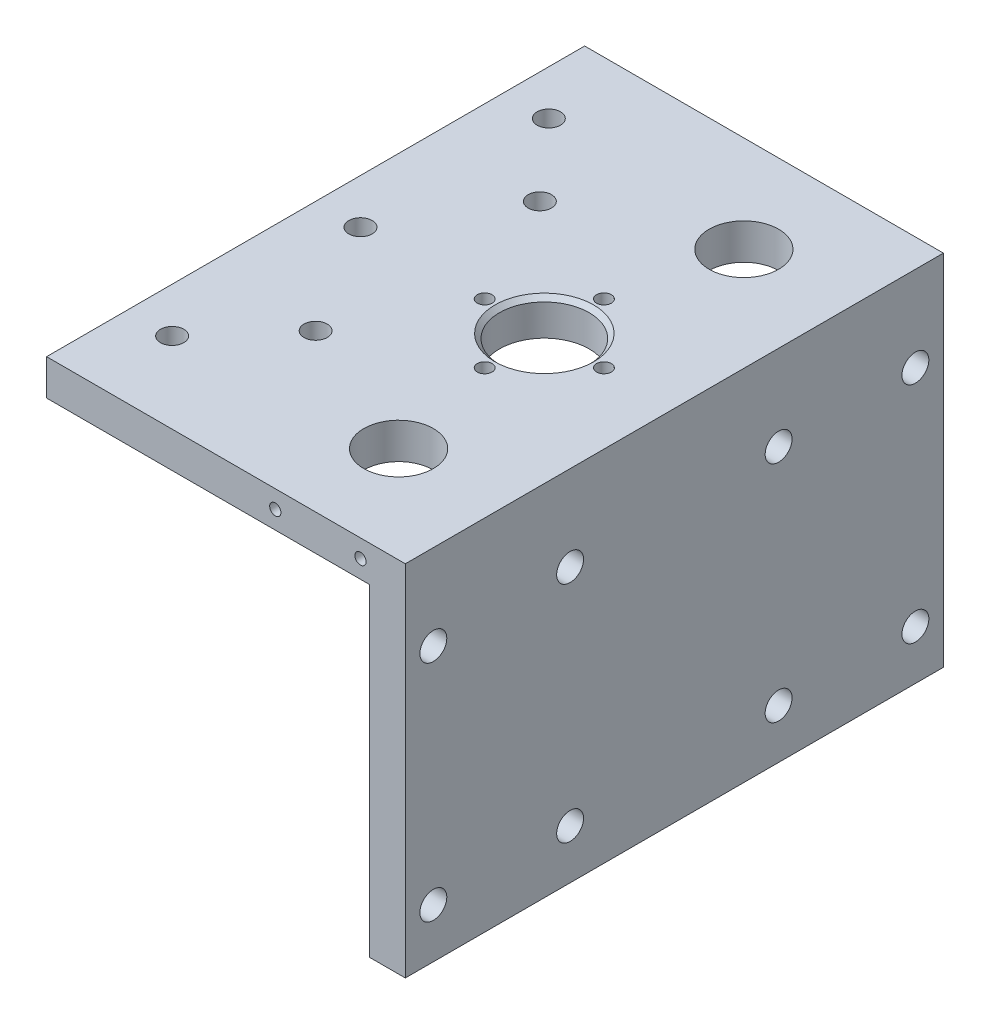
ISO-10303-21;
HEADER;
FILE_DESCRIPTION(('STEP AP214'),'2;1');
FILE_NAME('part.step','',(''),(''),'','','');
FILE_SCHEMA(('AUTOMOTIVE_DESIGN { 1 0 10303 214 1 1 1 1 }'));
ENDSEC;
DATA;
#1=APPLICATION_CONTEXT('core data for automotive mechanical design processes');
#2=APPLICATION_PROTOCOL_DEFINITION('international standard','automotive_design',2000,#1);
#3=PRODUCT_CONTEXT('',#1,'mechanical');
#4=PRODUCT('Part','Part','',(#3));
#5=PRODUCT_RELATED_PRODUCT_CATEGORY('part','',(#4));
#6=PRODUCT_DEFINITION_FORMATION('','',#4);
#7=PRODUCT_DEFINITION_CONTEXT('part definition',#1,'design');
#8=PRODUCT_DEFINITION('design','',#6,#7);
#9=PRODUCT_DEFINITION_SHAPE('','',#8);
#10=(LENGTH_UNIT() NAMED_UNIT(*) SI_UNIT(.MILLI.,.METRE.));
#11=(NAMED_UNIT(*) PLANE_ANGLE_UNIT() SI_UNIT($,.RADIAN.));
#12=(NAMED_UNIT(*) SI_UNIT($,.STERADIAN.) SOLID_ANGLE_UNIT());
#13=UNCERTAINTY_MEASURE_WITH_UNIT(LENGTH_MEASURE(1.E-05),#10,'distance_accuracy_value','');
#14=(GEOMETRIC_REPRESENTATION_CONTEXT(3) GLOBAL_UNCERTAINTY_ASSIGNED_CONTEXT((#13)) GLOBAL_UNIT_ASSIGNED_CONTEXT((#10,
#11,#12)) REPRESENTATION_CONTEXT('',''));
#15=CARTESIAN_POINT('',(0.,0.,0.));
#16=DIRECTION('',(0.,0.,1.));
#17=DIRECTION('',(1.,0.,0.));
#18=AXIS2_PLACEMENT_3D('',#15,#16,#17);
#19=CARTESIAN_POINT('',(0.,-80.,120.));
#20=DIRECTION('',(-1.,0.,0.));
#21=DIRECTION('',(0.,0.,1.));
#22=AXIS2_PLACEMENT_3D('',#19,#20,#21);
#23=PLANE('',#22);
#24=CARTESIAN_POINT('',(0.,-69.,36.75));
#25=DIRECTION('',(1.,0.,0.));
#26=DIRECTION('',(0.,0.,1.));
#27=AXIS2_PLACEMENT_3D('',#24,#25,#26);
#28=CIRCLE('',#27,3.);
#29=CARTESIAN_POINT('',(0.,-69.,39.75));
#30=VERTEX_POINT('',#29);
#31=EDGE_CURVE('E195',#30,#30,#28,.T.);
#32=ORIENTED_EDGE('',*,*,#31,.F.);
#33=EDGE_LOOP('',(#32));
#34=FACE_BOUND('',#33,.T.);
#35=CARTESIAN_POINT('',(0.,-69.,6.25));
#36=DIRECTION('',(1.,0.,0.));
#37=DIRECTION('',(0.,0.,-1.));
#38=AXIS2_PLACEMENT_3D('',#35,#36,#37);
#39=CIRCLE('',#38,3.);
#40=CARTESIAN_POINT('',(0.,-69.,3.25));
#41=VERTEX_POINT('',#40);
#42=EDGE_CURVE('E191',#41,#41,#39,.T.);
#43=ORIENTED_EDGE('',*,*,#42,.F.);
#44=EDGE_LOOP('',(#43));
#45=FACE_BOUND('',#44,.T.);
#46=CARTESIAN_POINT('',(0.,-69.,113.75));
#47=DIRECTION('',(1.,0.,0.));
#48=DIRECTION('',(0.,0.,1.));
#49=AXIS2_PLACEMENT_3D('',#46,#47,#48);
#50=CIRCLE('',#49,3.00000000000001);
#51=CARTESIAN_POINT('',(0.,-69.,116.75));
#52=VERTEX_POINT('',#51);
#53=EDGE_CURVE('E187',#52,#52,#50,.T.);
#54=ORIENTED_EDGE('',*,*,#53,.F.);
#55=EDGE_LOOP('',(#54));
#56=FACE_BOUND('',#55,.T.);
#57=CARTESIAN_POINT('',(0.,-69.,83.25));
#58=DIRECTION('',(1.,0.,0.));
#59=DIRECTION('',(0.,0.,-1.));
#60=AXIS2_PLACEMENT_3D('',#57,#58,#59);
#61=CIRCLE('',#60,3.00000000000001);
#62=CARTESIAN_POINT('',(0.,-69.,80.25));
#63=VERTEX_POINT('',#62);
#64=EDGE_CURVE('E183',#63,#63,#61,.T.);
#65=ORIENTED_EDGE('',*,*,#64,.F.);
#66=EDGE_LOOP('',(#65));
#67=FACE_BOUND('',#66,.T.);
#68=CARTESIAN_POINT('',(0.,-19.,6.25));
#69=DIRECTION('',(1.,0.,0.));
#70=DIRECTION('',(0.,0.,1.));
#71=AXIS2_PLACEMENT_3D('',#68,#69,#70);
#72=CIRCLE('',#71,3.);
#73=CARTESIAN_POINT('',(0.,-19.,9.25));
#74=VERTEX_POINT('',#73);
#75=EDGE_CURVE('E179',#74,#74,#72,.T.);
#76=ORIENTED_EDGE('',*,*,#75,.F.);
#77=EDGE_LOOP('',(#76));
#78=FACE_BOUND('',#77,.T.);
#79=CARTESIAN_POINT('',(0.,-19.,36.75));
#80=DIRECTION('',(1.,0.,0.));
#81=DIRECTION('',(0.,0.,-1.));
#82=AXIS2_PLACEMENT_3D('',#79,#80,#81);
#83=CIRCLE('',#82,3.);
#84=CARTESIAN_POINT('',(0.,-19.,33.75));
#85=VERTEX_POINT('',#84);
#86=EDGE_CURVE('E175',#85,#85,#83,.T.);
#87=ORIENTED_EDGE('',*,*,#86,.F.);
#88=EDGE_LOOP('',(#87));
#89=FACE_BOUND('',#88,.T.);
#90=CARTESIAN_POINT('',(0.,-19.,113.75));
#91=DIRECTION('',(1.,0.,0.));
#92=DIRECTION('',(0.,0.,-1.));
#93=AXIS2_PLACEMENT_3D('',#90,#91,#92);
#94=CIRCLE('',#93,3.00000000000001);
#95=CARTESIAN_POINT('',(0.,-19.,110.75));
#96=VERTEX_POINT('',#95);
#97=EDGE_CURVE('E171',#96,#96,#94,.T.);
#98=ORIENTED_EDGE('',*,*,#97,.F.);
#99=EDGE_LOOP('',(#98));
#100=FACE_BOUND('',#99,.T.);
#101=CARTESIAN_POINT('',(0.,-19.,83.25));
#102=DIRECTION('',(1.,0.,0.));
#103=DIRECTION('',(0.,0.,1.));
#104=AXIS2_PLACEMENT_3D('',#101,#102,#103);
#105=CIRCLE('',#104,3.00000000000001);
#106=CARTESIAN_POINT('',(0.,-19.,86.25));
#107=VERTEX_POINT('',#106);
#108=EDGE_CURVE('E167',#107,#107,#105,.T.);
#109=ORIENTED_EDGE('',*,*,#108,.F.);
#110=EDGE_LOOP('',(#109));
#111=FACE_BOUND('',#110,.T.);
#112=DIRECTION('',(0.,1.,0.));
#113=VECTOR('',#112,1.);
#114=CARTESIAN_POINT('',(0.,-80.,0.));
#115=LINE('',#114,#113);
#116=CARTESIAN_POINT('',(0.,-80.,0.));
#117=VERTEX_POINT('',#116);
#118=CARTESIAN_POINT('',(0.,0.,0.));
#119=VERTEX_POINT('',#118);
#120=EDGE_CURVE('E134',#117,#119,#115,.T.);
#121=ORIENTED_EDGE('',*,*,#120,.T.);
#122=DIRECTION('',(0.,0.,-1.));
#123=VECTOR('',#122,1.);
#124=CARTESIAN_POINT('',(0.,0.,120.));
#125=LINE('',#124,#123);
#126=CARTESIAN_POINT('',(0.,0.,120.));
#127=VERTEX_POINT('',#126);
#128=EDGE_CURVE('E152',#127,#119,#125,.T.);
#129=ORIENTED_EDGE('',*,*,#128,.F.);
#130=DIRECTION('',(0.,1.,0.));
#131=VECTOR('',#130,1.);
#132=CARTESIAN_POINT('',(0.,-80.,120.));
#133=LINE('',#132,#131);
#134=CARTESIAN_POINT('',(0.,-80.,120.));
#135=VERTEX_POINT('',#134);
#136=EDGE_CURVE('E145',#135,#127,#133,.T.);
#137=ORIENTED_EDGE('',*,*,#136,.F.);
#138=DIRECTION('',(0.,0.,-1.));
#139=VECTOR('',#138,1.);
#140=CARTESIAN_POINT('',(0.,-80.,120.));
#141=LINE('',#140,#139);
#142=EDGE_CURVE('E130',#135,#117,#141,.T.);
#143=ORIENTED_EDGE('',*,*,#142,.T.);
#144=EDGE_LOOP('',(#121,#129,#137,#143));
#145=FACE_BOUND('',#144,.T.);
#146=ADVANCED_FACE('F44',(#34,#45,#56,#67,#78,#89,#100,#111,#145),#23,.F.);
#147=CARTESIAN_POINT('',(0.,0.,120.));
#148=DIRECTION('',(0.,-1.,0.));
#149=DIRECTION('',(1.,0.,0.));
#150=AXIS2_PLACEMENT_3D('',#147,#148,#149);
#151=PLANE('',#150);
#152=CARTESIAN_POINT('',(-29.,0.,60.));
#153=DIRECTION('',(0.,-1.,0.));
#154=DIRECTION('',(1.,0.,0.));
#155=AXIS2_PLACEMENT_3D('',#152,#153,#154);
#156=CIRCLE('',#155,11.0000000000001);
#157=CARTESIAN_POINT('',(-17.9999999999999,0.,60.));
#158=VERTEX_POINT('',#157);
#159=EDGE_CURVE('E12',#158,#158,#156,.T.);
#160=ORIENTED_EDGE('',*,*,#159,.T.);
#161=EDGE_LOOP('',(#160));
#162=FACE_BOUND('',#161,.T.);
#163=CARTESIAN_POINT('',(-55.,0.,85.));
#164=DIRECTION('',(0.,1.,0.));
#165=DIRECTION('',(-1.,0.,0.));
#166=AXIS2_PLACEMENT_3D('',#163,#164,#165);
#167=CIRCLE('',#166,2.6);
#168=CARTESIAN_POINT('',(-57.6,0.,85.));
#169=VERTEX_POINT('',#168);
#170=EDGE_CURVE('E214',#169,#169,#167,.T.);
#171=ORIENTED_EDGE('',*,*,#170,.F.);
#172=EDGE_LOOP('',(#171));
#173=FACE_BOUND('',#172,.T.);
#174=CARTESIAN_POINT('',(-55.,0.,35.));
#175=DIRECTION('',(0.,1.,0.));
#176=DIRECTION('',(-1.,0.,0.));
#177=AXIS2_PLACEMENT_3D('',#174,#175,#176);
#178=CIRCLE('',#177,2.6);
#179=CARTESIAN_POINT('',(-57.6,0.,35.));
#180=VERTEX_POINT('',#179);
#181=EDGE_CURVE('E211',#180,#180,#178,.T.);
#182=ORIENTED_EDGE('',*,*,#181,.F.);
#183=EDGE_LOOP('',(#182));
#184=FACE_BOUND('',#183,.T.);
#185=CARTESIAN_POINT('',(-70.,0.,102.));
#186=DIRECTION('',(0.,1.,0.));
#187=DIRECTION('',(-1.,0.,0.));
#188=AXIS2_PLACEMENT_3D('',#185,#186,#187);
#189=CIRCLE('',#188,2.6);
#190=CARTESIAN_POINT('',(-72.6,0.,102.));
#191=VERTEX_POINT('',#190);
#192=EDGE_CURVE('E207',#191,#191,#189,.T.);
#193=ORIENTED_EDGE('',*,*,#192,.F.);
#194=EDGE_LOOP('',(#193));
#195=FACE_BOUND('',#194,.T.);
#196=CARTESIAN_POINT('',(-70.,0.,60.));
#197=DIRECTION('',(0.,1.,0.));
#198=DIRECTION('',(-1.,0.,0.));
#199=AXIS2_PLACEMENT_3D('',#196,#197,#198);
#200=CIRCLE('',#199,2.6);
#201=CARTESIAN_POINT('',(-72.6,0.,60.));
#202=VERTEX_POINT('',#201);
#203=EDGE_CURVE('E203',#202,#202,#200,.T.);
#204=ORIENTED_EDGE('',*,*,#203,.F.);
#205=EDGE_LOOP('',(#204));
#206=FACE_BOUND('',#205,.T.);
#207=CARTESIAN_POINT('',(-70.,0.,18.));
#208=DIRECTION('',(0.,1.,0.));
#209=DIRECTION('',(-1.,0.,0.));
#210=AXIS2_PLACEMENT_3D('',#207,#208,#209);
#211=CIRCLE('',#210,2.6);
#212=CARTESIAN_POINT('',(-72.6,0.,18.));
#213=VERTEX_POINT('',#212);
#214=EDGE_CURVE('E199',#213,#213,#211,.T.);
#215=ORIENTED_EDGE('',*,*,#214,.F.);
#216=EDGE_LOOP('',(#215));
#217=FACE_BOUND('',#216,.T.);
#218=CARTESIAN_POINT('',(-29.,0.,46.7));
#219=DIRECTION('',(0.,1.,0.));
#220=DIRECTION('',(0.,0.,1.));
#221=AXIS2_PLACEMENT_3D('',#218,#219,#220);
#222=CIRCLE('',#221,1.64999999999999);
#223=CARTESIAN_POINT('',(-29.,0.,48.35));
#224=VERTEX_POINT('',#223);
#225=EDGE_CURVE('E166',#224,#224,#222,.T.);
#226=ORIENTED_EDGE('',*,*,#225,.F.);
#227=EDGE_LOOP('',(#226));
#228=FACE_BOUND('',#227,.T.);
#229=CARTESIAN_POINT('',(-42.3,0.,60.));
#230=DIRECTION('',(0.,1.,0.));
#231=DIRECTION('',(0.,0.,1.));
#232=AXIS2_PLACEMENT_3D('',#229,#230,#231);
#233=CIRCLE('',#232,1.64999999999999);
#234=CARTESIAN_POINT('',(-42.3,0.,61.65));
#235=VERTEX_POINT('',#234);
#236=EDGE_CURVE('E468',#235,#235,#233,.T.);
#237=ORIENTED_EDGE('',*,*,#236,.F.);
#238=EDGE_LOOP('',(#237));
#239=FACE_BOUND('',#238,.T.);
#240=CARTESIAN_POINT('',(-29.,0.,73.3));
#241=DIRECTION('',(0.,1.,0.));
#242=DIRECTION('',(0.,0.,1.));
#243=AXIS2_PLACEMENT_3D('',#240,#241,#242);
#244=CIRCLE('',#243,1.64999999999999);
#245=CARTESIAN_POINT('',(-29.,0.,74.95));
#246=VERTEX_POINT('',#245);
#247=EDGE_CURVE('E162',#246,#246,#244,.T.);
#248=ORIENTED_EDGE('',*,*,#247,.F.);
#249=EDGE_LOOP('',(#248));
#250=FACE_BOUND('',#249,.T.);
#251=CARTESIAN_POINT('',(-15.7,0.,60.));
#252=DIRECTION('',(0.,1.,0.));
#253=DIRECTION('',(0.,0.,1.));
#254=AXIS2_PLACEMENT_3D('',#251,#252,#253);
#255=CIRCLE('',#254,1.64999999999999);
#256=CARTESIAN_POINT('',(-15.7,0.,61.65));
#257=VERTEX_POINT('',#256);
#258=EDGE_CURVE('E158',#257,#257,#255,.T.);
#259=ORIENTED_EDGE('',*,*,#258,.F.);
#260=EDGE_LOOP('',(#259));
#261=FACE_BOUND('',#260,.T.);
#262=CARTESIAN_POINT('',(-23.,0.,98.5));
#263=DIRECTION('',(0.,1.,0.));
#264=DIRECTION('',(-1.,0.,0.));
#265=AXIS2_PLACEMENT_3D('',#262,#263,#264);
#266=CIRCLE('',#265,7.75000000000001);
#267=CARTESIAN_POINT('',(-30.75,0.,98.5));
#268=VERTEX_POINT('',#267);
#269=EDGE_CURVE('E435',#268,#268,#266,.T.);
#270=ORIENTED_EDGE('',*,*,#269,.F.);
#271=EDGE_LOOP('',(#270));
#272=FACE_BOUND('',#271,.T.);
#273=CARTESIAN_POINT('',(-23.,0.,21.5));
#274=DIRECTION('',(0.,1.,0.));
#275=DIRECTION('',(-1.,0.,0.));
#276=AXIS2_PLACEMENT_3D('',#273,#274,#275);
#277=CIRCLE('',#276,7.75);
#278=CARTESIAN_POINT('',(-30.75,0.,21.5));
#279=VERTEX_POINT('',#278);
#280=EDGE_CURVE('E442',#279,#279,#277,.T.);
#281=ORIENTED_EDGE('',*,*,#280,.F.);
#282=EDGE_LOOP('',(#281));
#283=FACE_BOUND('',#282,.T.);
#284=DIRECTION('',(-1.,0.,0.));
#285=VECTOR('',#284,1.);
#286=CARTESIAN_POINT('',(0.,0.,0.));
#287=LINE('',#286,#285);
#288=CARTESIAN_POINT('',(-80.,0.,0.));
#289=VERTEX_POINT('',#288);
#290=EDGE_CURVE('E137',#119,#289,#287,.T.);
#291=ORIENTED_EDGE('',*,*,#290,.T.);
#292=DIRECTION('',(0.,0.,-1.));
#293=VECTOR('',#292,1.);
#294=CARTESIAN_POINT('',(-80.,0.,120.));
#295=LINE('',#294,#293);
#296=CARTESIAN_POINT('',(-80.,0.,120.));
#297=VERTEX_POINT('',#296);
#298=EDGE_CURVE('E149',#297,#289,#295,.T.);
#299=ORIENTED_EDGE('',*,*,#298,.F.);
#300=DIRECTION('',(-1.,0.,0.));
#301=VECTOR('',#300,1.);
#302=CARTESIAN_POINT('',(0.,0.,120.));
#303=LINE('',#302,#301);
#304=EDGE_CURVE('E101',#127,#297,#303,.T.);
#305=ORIENTED_EDGE('',*,*,#304,.F.);
#306=ORIENTED_EDGE('',*,*,#128,.T.);
#307=EDGE_LOOP('',(#291,#299,#305,#306));
#308=FACE_BOUND('',#307,.T.);
#309=ADVANCED_FACE('F240',(#162,#173,#184,#195,#206,#217,#228,#239,#250,#261,#272,#283,#308),
#151,.F.);
#310=CARTESIAN_POINT('',(-80.,0.,120.));
#311=DIRECTION('',(1.,0.,0.));
#312=DIRECTION('',(0.,0.,-1.));
#313=AXIS2_PLACEMENT_3D('',#310,#311,#312);
#314=PLANE('',#313);
#315=DIRECTION('',(0.,-1.,0.));
#316=VECTOR('',#315,1.);
#317=CARTESIAN_POINT('',(-80.,0.,0.));
#318=LINE('',#317,#316);
#319=CARTESIAN_POINT('',(-80.,-8.00000000000001,0.));
#320=VERTEX_POINT('',#319);
#321=EDGE_CURVE('E140',#289,#320,#318,.T.);
#322=ORIENTED_EDGE('',*,*,#321,.T.);
#323=DIRECTION('',(0.,0.,-1.));
#324=VECTOR('',#323,1.);
#325=CARTESIAN_POINT('',(-80.,-8.00000000000001,120.));
#326=LINE('',#325,#324);
#327=CARTESIAN_POINT('',(-80.,-8.00000000000001,120.));
#328=VERTEX_POINT('',#327);
#329=EDGE_CURVE('E125',#328,#320,#326,.T.);
#330=ORIENTED_EDGE('',*,*,#329,.F.);
#331=DIRECTION('',(0.,-1.,0.));
#332=VECTOR('',#331,1.);
#333=CARTESIAN_POINT('',(-80.,0.,120.));
#334=LINE('',#333,#332);
#335=EDGE_CURVE('E116',#297,#328,#334,.T.);
#336=ORIENTED_EDGE('',*,*,#335,.F.);
#337=ORIENTED_EDGE('',*,*,#298,.T.);
#338=EDGE_LOOP('',(#322,#330,#336,#337));
#339=FACE_BOUND('',#338,.T.);
#340=ADVANCED_FACE('F245',(#339),#314,.F.);
#341=CARTESIAN_POINT('',(-80.,-8.00000000000001,120.));
#342=DIRECTION('',(0.,1.,0.));
#343=DIRECTION('',(0.,0.,1.));
#344=AXIS2_PLACEMENT_3D('',#341,#342,#343);
#345=PLANE('',#344);
#346=CARTESIAN_POINT('',(-55.,-8.00000000000001,85.));
#347=DIRECTION('',(0.,1.,0.));
#348=DIRECTION('',(0.,0.,1.));
#349=AXIS2_PLACEMENT_3D('',#346,#347,#348);
#350=CIRCLE('',#349,2.6);
#351=CARTESIAN_POINT('',(-55.,-8.00000000000001,87.6));
#352=VERTEX_POINT('',#351);
#353=EDGE_CURVE('E212',#352,#352,#350,.T.);
#354=ORIENTED_EDGE('',*,*,#353,.T.);
#355=EDGE_LOOP('',(#354));
#356=FACE_BOUND('',#355,.T.);
#357=CARTESIAN_POINT('',(-55.,-8.00000000000001,35.));
#358=DIRECTION('',(0.,1.,0.));
#359=DIRECTION('',(0.,0.,1.));
#360=AXIS2_PLACEMENT_3D('',#357,#358,#359);
#361=CIRCLE('',#360,2.6);
#362=CARTESIAN_POINT('',(-55.,-8.00000000000001,37.6));
#363=VERTEX_POINT('',#362);
#364=EDGE_CURVE('E208',#363,#363,#361,.T.);
#365=ORIENTED_EDGE('',*,*,#364,.T.);
#366=EDGE_LOOP('',(#365));
#367=FACE_BOUND('',#366,.T.);
#368=CARTESIAN_POINT('',(-70.,-8.00000000000001,102.));
#369=DIRECTION('',(0.,1.,0.));
#370=DIRECTION('',(0.,0.,1.));
#371=AXIS2_PLACEMENT_3D('',#368,#369,#370);
#372=CIRCLE('',#371,2.6);
#373=CARTESIAN_POINT('',(-70.,-8.00000000000001,104.6));
#374=VERTEX_POINT('',#373);
#375=EDGE_CURVE('E204',#374,#374,#372,.T.);
#376=ORIENTED_EDGE('',*,*,#375,.T.);
#377=EDGE_LOOP('',(#376));
#378=FACE_BOUND('',#377,.T.);
#379=CARTESIAN_POINT('',(-70.,-8.00000000000001,60.));
#380=DIRECTION('',(0.,1.,0.));
#381=DIRECTION('',(0.,0.,1.));
#382=AXIS2_PLACEMENT_3D('',#379,#380,#381);
#383=CIRCLE('',#382,2.6);
#384=CARTESIAN_POINT('',(-70.,-8.00000000000001,62.6));
#385=VERTEX_POINT('',#384);
#386=EDGE_CURVE('E200',#385,#385,#383,.T.);
#387=ORIENTED_EDGE('',*,*,#386,.T.);
#388=EDGE_LOOP('',(#387));
#389=FACE_BOUND('',#388,.T.);
#390=CARTESIAN_POINT('',(-70.,-8.00000000000001,18.));
#391=DIRECTION('',(0.,1.,0.));
#392=DIRECTION('',(0.,0.,1.));
#393=AXIS2_PLACEMENT_3D('',#390,#391,#392);
#394=CIRCLE('',#393,2.6);
#395=CARTESIAN_POINT('',(-70.,-8.00000000000001,20.6));
#396=VERTEX_POINT('',#395);
#397=EDGE_CURVE('E196',#396,#396,#394,.T.);
#398=ORIENTED_EDGE('',*,*,#397,.T.);
#399=EDGE_LOOP('',(#398));
#400=FACE_BOUND('',#399,.T.);
#401=CARTESIAN_POINT('',(-29.,-8.00000000000001,46.7));
#402=DIRECTION('',(0.,1.,0.));
#403=DIRECTION('',(0.,0.,1.));
#404=AXIS2_PLACEMENT_3D('',#401,#402,#403);
#405=CIRCLE('',#404,1.64999999999999);
#406=CARTESIAN_POINT('',(-29.,-8.00000000000001,48.35));
#407=VERTEX_POINT('',#406);
#408=EDGE_CURVE('E417',#407,#407,#405,.T.);
#409=ORIENTED_EDGE('',*,*,#408,.T.);
#410=EDGE_LOOP('',(#409));
#411=FACE_BOUND('',#410,.T.);
#412=CARTESIAN_POINT('',(-42.3,-8.00000000000001,60.));
#413=DIRECTION('',(0.,1.,0.));
#414=DIRECTION('',(0.,0.,1.));
#415=AXIS2_PLACEMENT_3D('',#412,#413,#414);
#416=CIRCLE('',#415,1.64999999999998);
#417=CARTESIAN_POINT('',(-42.3,-8.00000000000001,61.65));
#418=VERTEX_POINT('',#417);
#419=EDGE_CURVE('E467',#418,#418,#416,.T.);
#420=ORIENTED_EDGE('',*,*,#419,.T.);
#421=EDGE_LOOP('',(#420));
#422=FACE_BOUND('',#421,.T.);
#423=CARTESIAN_POINT('',(-29.,-8.00000000000001,73.3));
#424=DIRECTION('',(0.,1.,0.));
#425=DIRECTION('',(0.,0.,1.));
#426=AXIS2_PLACEMENT_3D('',#423,#424,#425);
#427=CIRCLE('',#426,1.64999999999999);
#428=CARTESIAN_POINT('',(-29.,-8.00000000000001,74.95));
#429=VERTEX_POINT('',#428);
#430=EDGE_CURVE('E159',#429,#429,#427,.T.);
#431=ORIENTED_EDGE('',*,*,#430,.T.);
#432=EDGE_LOOP('',(#431));
#433=FACE_BOUND('',#432,.T.);
#434=CARTESIAN_POINT('',(-15.7,-8.00000000000001,60.));
#435=DIRECTION('',(0.,1.,0.));
#436=DIRECTION('',(0.,0.,1.));
#437=AXIS2_PLACEMENT_3D('',#434,#435,#436);
#438=CIRCLE('',#437,1.64999999999999);
#439=CARTESIAN_POINT('',(-15.7,-8.00000000000001,61.65));
#440=VERTEX_POINT('',#439);
#441=EDGE_CURVE('E154',#440,#440,#438,.T.);
#442=ORIENTED_EDGE('',*,*,#441,.T.);
#443=EDGE_LOOP('',(#442));
#444=FACE_BOUND('',#443,.T.);
#445=CARTESIAN_POINT('',(-29.,-8.00000000000001,60.));
#446=DIRECTION('',(0.,1.,0.));
#447=DIRECTION('',(0.,0.,1.));
#448=AXIS2_PLACEMENT_3D('',#445,#446,#447);
#449=CIRCLE('',#448,10.);
#450=CARTESIAN_POINT('',(-29.,-8.00000000000001,70.));
#451=VERTEX_POINT('',#450);
#452=EDGE_CURVE('E157',#451,#451,#449,.F.);
#453=ORIENTED_EDGE('',*,*,#452,.F.);
#454=EDGE_LOOP('',(#453));
#455=FACE_BOUND('',#454,.T.);
#456=CARTESIAN_POINT('',(-23.,-8.00000000000001,98.5));
#457=DIRECTION('',(0.,1.,0.));
#458=DIRECTION('',(0.,0.,1.));
#459=AXIS2_PLACEMENT_3D('',#456,#457,#458);
#460=CIRCLE('',#459,7.75000000000001);
#461=CARTESIAN_POINT('',(-23.,-8.00000000000001,106.25));
#462=VERTEX_POINT('',#461);
#463=EDGE_CURVE('E439',#462,#462,#460,.F.);
#464=ORIENTED_EDGE('',*,*,#463,.F.);
#465=EDGE_LOOP('',(#464));
#466=FACE_BOUND('',#465,.T.);
#467=CARTESIAN_POINT('',(-23.,-8.00000000000001,21.5));
#468=DIRECTION('',(0.,1.,0.));
#469=DIRECTION('',(0.,0.,1.));
#470=AXIS2_PLACEMENT_3D('',#467,#468,#469);
#471=CIRCLE('',#470,7.75);
#472=CARTESIAN_POINT('',(-23.,-8.00000000000001,29.25));
#473=VERTEX_POINT('',#472);
#474=EDGE_CURVE('E138',#473,#473,#471,.F.);
#475=ORIENTED_EDGE('',*,*,#474,.F.);
#476=EDGE_LOOP('',(#475));
#477=FACE_BOUND('',#476,.T.);
#478=DIRECTION('',(1.,0.,0.));
#479=VECTOR('',#478,1.);
#480=CARTESIAN_POINT('',(-80.,-8.00000000000001,0.));
#481=LINE('',#480,#479);
#482=CARTESIAN_POINT('',(-8.00000000000001,-8.00000000000001,0.));
#483=VERTEX_POINT('',#482);
#484=EDGE_CURVE('E124',#320,#483,#481,.T.);
#485=ORIENTED_EDGE('',*,*,#484,.T.);
#486=DIRECTION('',(0.,0.,-1.));
#487=VECTOR('',#486,1.);
#488=CARTESIAN_POINT('',(-8.00000000000001,-8.00000000000001,120.));
#489=LINE('',#488,#487);
#490=CARTESIAN_POINT('',(-8.00000000000001,-8.00000000000001,120.));
#491=VERTEX_POINT('',#490);
#492=EDGE_CURVE('E121',#491,#483,#489,.T.);
#493=ORIENTED_EDGE('',*,*,#492,.F.);
#494=DIRECTION('',(1.,0.,0.));
#495=VECTOR('',#494,1.);
#496=CARTESIAN_POINT('',(-80.,-8.00000000000001,120.));
#497=LINE('',#496,#495);
#498=EDGE_CURVE('E110',#328,#491,#497,.T.);
#499=ORIENTED_EDGE('',*,*,#498,.F.);
#500=ORIENTED_EDGE('',*,*,#329,.T.);
#501=EDGE_LOOP('',(#485,#493,#499,#500));
#502=FACE_BOUND('',#501,.T.);
#503=ADVANCED_FACE('F122',(#356,#367,#378,#389,#400,#411,#422,#433,#444,#455,#466,#477,#502),
#345,.F.);
#504=CARTESIAN_POINT('',(-8.00000000000001,-8.00000000000001,120.));
#505=DIRECTION('',(1.,0.,0.));
#506=DIRECTION('',(0.,1.,0.));
#507=AXIS2_PLACEMENT_3D('',#504,#505,#506);
#508=PLANE('',#507);
#509=CARTESIAN_POINT('',(-8.,-69.,36.75));
#510=DIRECTION('',(1.,0.,0.));
#511=DIRECTION('',(0.,1.,0.));
#512=AXIS2_PLACEMENT_3D('',#509,#510,#511);
#513=CIRCLE('',#512,3.);
#514=CARTESIAN_POINT('',(-8.,-66.,36.75));
#515=VERTEX_POINT('',#514);
#516=EDGE_CURVE('E192',#515,#515,#513,.T.);
#517=ORIENTED_EDGE('',*,*,#516,.T.);
#518=EDGE_LOOP('',(#517));
#519=FACE_BOUND('',#518,.T.);
#520=CARTESIAN_POINT('',(-8.,-69.,6.25));
#521=DIRECTION('',(1.,0.,0.));
#522=DIRECTION('',(0.,1.,0.));
#523=AXIS2_PLACEMENT_3D('',#520,#521,#522);
#524=CIRCLE('',#523,3.);
#525=CARTESIAN_POINT('',(-8.,-66.,6.25));
#526=VERTEX_POINT('',#525);
#527=EDGE_CURVE('E188',#526,#526,#524,.T.);
#528=ORIENTED_EDGE('',*,*,#527,.T.);
#529=EDGE_LOOP('',(#528));
#530=FACE_BOUND('',#529,.T.);
#531=CARTESIAN_POINT('',(-8.,-69.,113.75));
#532=DIRECTION('',(1.,0.,0.));
#533=DIRECTION('',(0.,1.,0.));
#534=AXIS2_PLACEMENT_3D('',#531,#532,#533);
#535=CIRCLE('',#534,3.00000000000001);
#536=CARTESIAN_POINT('',(-8.,-66.,113.75));
#537=VERTEX_POINT('',#536);
#538=EDGE_CURVE('E184',#537,#537,#535,.T.);
#539=ORIENTED_EDGE('',*,*,#538,.T.);
#540=EDGE_LOOP('',(#539));
#541=FACE_BOUND('',#540,.T.);
#542=CARTESIAN_POINT('',(-8.,-69.,83.25));
#543=DIRECTION('',(1.,0.,0.));
#544=DIRECTION('',(0.,1.,0.));
#545=AXIS2_PLACEMENT_3D('',#542,#543,#544);
#546=CIRCLE('',#545,3.00000000000001);
#547=CARTESIAN_POINT('',(-8.,-66.,83.25));
#548=VERTEX_POINT('',#547);
#549=EDGE_CURVE('E180',#548,#548,#546,.T.);
#550=ORIENTED_EDGE('',*,*,#549,.T.);
#551=EDGE_LOOP('',(#550));
#552=FACE_BOUND('',#551,.T.);
#553=CARTESIAN_POINT('',(-8.00000000000001,-19.,6.25));
#554=DIRECTION('',(1.,0.,0.));
#555=DIRECTION('',(0.,1.,0.));
#556=AXIS2_PLACEMENT_3D('',#553,#554,#555);
#557=CIRCLE('',#556,3.);
#558=CARTESIAN_POINT('',(-8.00000000000001,-16.,6.25));
#559=VERTEX_POINT('',#558);
#560=EDGE_CURVE('E176',#559,#559,#557,.T.);
#561=ORIENTED_EDGE('',*,*,#560,.T.);
#562=EDGE_LOOP('',(#561));
#563=FACE_BOUND('',#562,.T.);
#564=CARTESIAN_POINT('',(-8.00000000000001,-19.,36.75));
#565=DIRECTION('',(1.,0.,0.));
#566=DIRECTION('',(0.,1.,0.));
#567=AXIS2_PLACEMENT_3D('',#564,#565,#566);
#568=CIRCLE('',#567,3.);
#569=CARTESIAN_POINT('',(-8.00000000000001,-16.,36.75));
#570=VERTEX_POINT('',#569);
#571=EDGE_CURVE('E172',#570,#570,#568,.T.);
#572=ORIENTED_EDGE('',*,*,#571,.T.);
#573=EDGE_LOOP('',(#572));
#574=FACE_BOUND('',#573,.T.);
#575=CARTESIAN_POINT('',(-8.00000000000001,-19.,113.75));
#576=DIRECTION('',(1.,0.,0.));
#577=DIRECTION('',(0.,1.,0.));
#578=AXIS2_PLACEMENT_3D('',#575,#576,#577);
#579=CIRCLE('',#578,3.00000000000001);
#580=CARTESIAN_POINT('',(-8.00000000000001,-16.,113.75));
#581=VERTEX_POINT('',#580);
#582=EDGE_CURVE('E168',#581,#581,#579,.T.);
#583=ORIENTED_EDGE('',*,*,#582,.T.);
#584=EDGE_LOOP('',(#583));
#585=FACE_BOUND('',#584,.T.);
#586=CARTESIAN_POINT('',(-8.00000000000001,-19.,83.25));
#587=DIRECTION('',(1.,0.,0.));
#588=DIRECTION('',(0.,1.,0.));
#589=AXIS2_PLACEMENT_3D('',#586,#587,#588);
#590=CIRCLE('',#589,3.00000000000001);
#591=CARTESIAN_POINT('',(-8.00000000000001,-16.,83.25));
#592=VERTEX_POINT('',#591);
#593=EDGE_CURVE('E163',#592,#592,#590,.T.);
#594=ORIENTED_EDGE('',*,*,#593,.T.);
#595=EDGE_LOOP('',(#594));
#596=FACE_BOUND('',#595,.T.);
#597=DIRECTION('',(0.,-1.,0.));
#598=VECTOR('',#597,1.);
#599=CARTESIAN_POINT('',(-8.00000000000001,-8.00000000000001,0.));
#600=LINE('',#599,#598);
#601=CARTESIAN_POINT('',(-8.,-80.,0.));
#602=VERTEX_POINT('',#601);
#603=EDGE_CURVE('E86',#483,#602,#600,.T.);
#604=ORIENTED_EDGE('',*,*,#603,.T.);
#605=DIRECTION('',(0.,0.,-1.));
#606=VECTOR('',#605,1.);
#607=CARTESIAN_POINT('',(-8.,-80.,120.));
#608=LINE('',#607,#606);
#609=CARTESIAN_POINT('',(-8.,-80.,120.));
#610=VERTEX_POINT('',#609);
#611=EDGE_CURVE('E126',#610,#602,#608,.T.);
#612=ORIENTED_EDGE('',*,*,#611,.F.);
#613=DIRECTION('',(0.,-1.,0.));
#614=VECTOR('',#613,1.);
#615=CARTESIAN_POINT('',(-8.00000000000001,-8.00000000000001,120.));
#616=LINE('',#615,#614);
#617=EDGE_CURVE('E114',#491,#610,#616,.T.);
#618=ORIENTED_EDGE('',*,*,#617,.F.);
#619=ORIENTED_EDGE('',*,*,#492,.T.);
#620=EDGE_LOOP('',(#604,#612,#618,#619));
#621=FACE_BOUND('',#620,.T.);
#622=ADVANCED_FACE('F128',(#519,#530,#541,#552,#563,#574,#585,#596,#621),#508,.F.);
#623=CARTESIAN_POINT('',(-8.,-80.,120.));
#624=DIRECTION('',(0.,1.,0.));
#625=DIRECTION('',(0.,0.,1.));
#626=AXIS2_PLACEMENT_3D('',#623,#624,#625);
#627=PLANE('',#626);
#628=DIRECTION('',(1.,0.,0.));
#629=VECTOR('',#628,1.);
#630=CARTESIAN_POINT('',(-8.,-80.,0.));
#631=LINE('',#630,#629);
#632=EDGE_CURVE('E92',#602,#117,#631,.T.);
#633=ORIENTED_EDGE('',*,*,#632,.T.);
#634=ORIENTED_EDGE('',*,*,#142,.F.);
#635=DIRECTION('',(1.,0.,0.));
#636=VECTOR('',#635,1.);
#637=CARTESIAN_POINT('',(-8.,-80.,120.));
#638=LINE('',#637,#636);
#639=EDGE_CURVE('E61',#610,#135,#638,.T.);
#640=ORIENTED_EDGE('',*,*,#639,.F.);
#641=ORIENTED_EDGE('',*,*,#611,.T.);
#642=EDGE_LOOP('',(#633,#634,#640,#641));
#643=FACE_BOUND('',#642,.T.);
#644=ADVANCED_FACE('F259',(#643),#627,.F.);
#645=CARTESIAN_POINT('',(0.,0.,120.));
#646=DIRECTION('',(0.,0.,1.));
#647=DIRECTION('',(1.,0.,0.));
#648=AXIS2_PLACEMENT_3D('',#645,#646,#647);
#649=PLANE('',#648);
#650=CARTESIAN_POINT('',(-10.,-4.00000000000002,120.));
#651=DIRECTION('',(0.,0.,1.));
#652=DIRECTION('',(1.,0.,0.));
#653=AXIS2_PLACEMENT_3D('',#650,#651,#652);
#654=CIRCLE('',#653,1.25);
#655=CARTESIAN_POINT('',(-8.75,-4.00000000000002,120.));
#656=VERTEX_POINT('',#655);
#657=EDGE_CURVE('E361',#656,#656,#654,.T.);
#658=ORIENTED_EDGE('',*,*,#657,.F.);
#659=EDGE_LOOP('',(#658));
#660=FACE_BOUND('',#659,.T.);
#661=CARTESIAN_POINT('',(-29.,-4.00000000000001,120.));
#662=DIRECTION('',(0.,0.,1.));
#663=DIRECTION('',(1.,0.,0.));
#664=AXIS2_PLACEMENT_3D('',#661,#662,#663);
#665=CIRCLE('',#664,1.25);
#666=CARTESIAN_POINT('',(-27.75,-4.00000000000001,120.));
#667=VERTEX_POINT('',#666);
#668=EDGE_CURVE('E363',#667,#667,#665,.T.);
#669=ORIENTED_EDGE('',*,*,#668,.F.);
#670=EDGE_LOOP('',(#669));
#671=FACE_BOUND('',#670,.T.);
#672=ORIENTED_EDGE('',*,*,#136,.T.);
#673=ORIENTED_EDGE('',*,*,#304,.T.);
#674=ORIENTED_EDGE('',*,*,#335,.T.);
#675=ORIENTED_EDGE('',*,*,#498,.T.);
#676=ORIENTED_EDGE('',*,*,#617,.T.);
#677=ORIENTED_EDGE('',*,*,#639,.T.);
#678=EDGE_LOOP('',(#672,#673,#674,#675,#676,#677));
#679=FACE_BOUND('',#678,.T.);
#680=ADVANCED_FACE('F112',(#660,#671,#679),#649,.T.);
#681=CARTESIAN_POINT('',(0.,0.,0.));
#682=DIRECTION('',(0.,0.,1.));
#683=DIRECTION('',(1.,0.,0.));
#684=AXIS2_PLACEMENT_3D('',#681,#682,#683);
#685=PLANE('',#684);
#686=ORIENTED_EDGE('',*,*,#120,.F.);
#687=ORIENTED_EDGE('',*,*,#632,.F.);
#688=ORIENTED_EDGE('',*,*,#603,.F.);
#689=ORIENTED_EDGE('',*,*,#484,.F.);
#690=ORIENTED_EDGE('',*,*,#321,.F.);
#691=ORIENTED_EDGE('',*,*,#290,.F.);
#692=EDGE_LOOP('',(#686,#687,#688,#689,#690,#691));
#693=FACE_BOUND('',#692,.T.);
#694=ADVANCED_FACE('F263',(#693),#685,.F.);
#695=CARTESIAN_POINT('',(-23.,-80.001,21.5));
#696=DIRECTION('',(0.,1.,0.));
#697=DIRECTION('',(-1.,0.,0.));
#698=AXIS2_PLACEMENT_3D('',#695,#696,#697);
#699=CYLINDRICAL_SURFACE('',#698,7.75);
#700=ORIENTED_EDGE('',*,*,#280,.T.);
#701=EDGE_LOOP('',(#700));
#702=FACE_BOUND('',#701,.T.);
#703=ORIENTED_EDGE('',*,*,#474,.T.);
#704=EDGE_LOOP('',(#703));
#705=FACE_BOUND('',#704,.T.);
#706=ADVANCED_FACE('F266',(#702,#705),#699,.F.);
#707=CARTESIAN_POINT('',(-23.,-80.001,98.5));
#708=DIRECTION('',(0.,1.,0.));
#709=DIRECTION('',(-1.,0.,0.));
#710=AXIS2_PLACEMENT_3D('',#707,#708,#709);
#711=CYLINDRICAL_SURFACE('',#710,7.75000000000001);
#712=ORIENTED_EDGE('',*,*,#269,.T.);
#713=EDGE_LOOP('',(#712));
#714=FACE_BOUND('',#713,.T.);
#715=ORIENTED_EDGE('',*,*,#463,.T.);
#716=EDGE_LOOP('',(#715));
#717=FACE_BOUND('',#716,.T.);
#718=ADVANCED_FACE('F273',(#714,#717),#711,.F.);
#719=CARTESIAN_POINT('',(-29.,-80.001,60.));
#720=DIRECTION('',(0.,1.,0.));
#721=DIRECTION('',(-1.,0.,0.));
#722=AXIS2_PLACEMENT_3D('',#719,#720,#721);
#723=CYLINDRICAL_SURFACE('',#722,10.);
#724=CARTESIAN_POINT('',(-29.,-1.00000000000006,60.));
#725=DIRECTION('',(0.,-1.,0.));
#726=DIRECTION('',(0.,0.,-1.));
#727=AXIS2_PLACEMENT_3D('',#724,#725,#726);
#728=CIRCLE('',#727,10.);
#729=CARTESIAN_POINT('',(-29.,-1.00000000000006,50.));
#730=VERTEX_POINT('',#729);
#731=EDGE_CURVE('E53',#730,#730,#728,.F.);
#732=ORIENTED_EDGE('',*,*,#731,.T.);
#733=EDGE_LOOP('',(#732));
#734=FACE_BOUND('',#733,.T.);
#735=ORIENTED_EDGE('',*,*,#452,.T.);
#736=EDGE_LOOP('',(#735));
#737=FACE_BOUND('',#736,.T.);
#738=ADVANCED_FACE('F221',(#734,#737),#723,.F.);
#739=CARTESIAN_POINT('',(-15.7,0.,60.));
#740=DIRECTION('',(0.,1.,0.));
#741=DIRECTION('',(0.,0.,1.));
#742=AXIS2_PLACEMENT_3D('',#739,#740,#741);
#743=CYLINDRICAL_SURFACE('',#742,1.64999999999999);
#744=ORIENTED_EDGE('',*,*,#258,.T.);
#745=EDGE_LOOP('',(#744));
#746=FACE_BOUND('',#745,.T.);
#747=ORIENTED_EDGE('',*,*,#441,.F.);
#748=EDGE_LOOP('',(#747));
#749=FACE_BOUND('',#748,.T.);
#750=ADVANCED_FACE('F280',(#746,#749),#743,.F.);
#751=CARTESIAN_POINT('',(-29.,0.,73.3));
#752=DIRECTION('',(0.,1.,0.));
#753=DIRECTION('',(0.,0.,1.));
#754=AXIS2_PLACEMENT_3D('',#751,#752,#753);
#755=CYLINDRICAL_SURFACE('',#754,1.64999999999999);
#756=ORIENTED_EDGE('',*,*,#247,.T.);
#757=EDGE_LOOP('',(#756));
#758=FACE_BOUND('',#757,.T.);
#759=ORIENTED_EDGE('',*,*,#430,.F.);
#760=EDGE_LOOP('',(#759));
#761=FACE_BOUND('',#760,.T.);
#762=ADVANCED_FACE('F283',(#758,#761),#755,.F.);
#763=CARTESIAN_POINT('',(-42.3,0.,60.));
#764=DIRECTION('',(0.,1.,0.));
#765=DIRECTION('',(0.,0.,1.));
#766=AXIS2_PLACEMENT_3D('',#763,#764,#765);
#767=CYLINDRICAL_SURFACE('',#766,1.64999999999998);
#768=ORIENTED_EDGE('',*,*,#236,.T.);
#769=EDGE_LOOP('',(#768));
#770=FACE_BOUND('',#769,.T.);
#771=ORIENTED_EDGE('',*,*,#419,.F.);
#772=EDGE_LOOP('',(#771));
#773=FACE_BOUND('',#772,.T.);
#774=ADVANCED_FACE('F287',(#770,#773),#767,.F.);
#775=CARTESIAN_POINT('',(-29.,0.,46.7));
#776=DIRECTION('',(0.,1.,0.));
#777=DIRECTION('',(0.,0.,1.));
#778=AXIS2_PLACEMENT_3D('',#775,#776,#777);
#779=CYLINDRICAL_SURFACE('',#778,1.64999999999999);
#780=ORIENTED_EDGE('',*,*,#225,.T.);
#781=EDGE_LOOP('',(#780));
#782=FACE_BOUND('',#781,.T.);
#783=ORIENTED_EDGE('',*,*,#408,.F.);
#784=EDGE_LOOP('',(#783));
#785=FACE_BOUND('',#784,.T.);
#786=ADVANCED_FACE('F291',(#782,#785),#779,.F.);
#787=CARTESIAN_POINT('',(-10.,-19.,83.25));
#788=DIRECTION('',(1.,0.,0.));
#789=DIRECTION('',(0.,0.,-1.));
#790=AXIS2_PLACEMENT_3D('',#787,#788,#789);
#791=CYLINDRICAL_SURFACE('',#790,3.00000000000001);
#792=ORIENTED_EDGE('',*,*,#108,.T.);
#793=EDGE_LOOP('',(#792));
#794=FACE_BOUND('',#793,.T.);
#795=ORIENTED_EDGE('',*,*,#593,.F.);
#796=EDGE_LOOP('',(#795));
#797=FACE_BOUND('',#796,.T.);
#798=ADVANCED_FACE('F295',(#794,#797),#791,.F.);
#799=CARTESIAN_POINT('',(-10.,-19.,113.75));
#800=DIRECTION('',(1.,0.,0.));
#801=DIRECTION('',(0.,0.,-1.));
#802=AXIS2_PLACEMENT_3D('',#799,#800,#801);
#803=CYLINDRICAL_SURFACE('',#802,3.00000000000001);
#804=ORIENTED_EDGE('',*,*,#97,.T.);
#805=EDGE_LOOP('',(#804));
#806=FACE_BOUND('',#805,.T.);
#807=ORIENTED_EDGE('',*,*,#582,.F.);
#808=EDGE_LOOP('',(#807));
#809=FACE_BOUND('',#808,.T.);
#810=ADVANCED_FACE('F299',(#806,#809),#803,.F.);
#811=CARTESIAN_POINT('',(-10.,-19.,36.75));
#812=DIRECTION('',(1.,0.,0.));
#813=DIRECTION('',(0.,0.,-1.));
#814=AXIS2_PLACEMENT_3D('',#811,#812,#813);
#815=CYLINDRICAL_SURFACE('',#814,3.);
#816=ORIENTED_EDGE('',*,*,#86,.T.);
#817=EDGE_LOOP('',(#816));
#818=FACE_BOUND('',#817,.T.);
#819=ORIENTED_EDGE('',*,*,#571,.F.);
#820=EDGE_LOOP('',(#819));
#821=FACE_BOUND('',#820,.T.);
#822=ADVANCED_FACE('F303',(#818,#821),#815,.F.);
#823=CARTESIAN_POINT('',(-10.,-19.,6.25));
#824=DIRECTION('',(1.,0.,0.));
#825=DIRECTION('',(0.,0.,-1.));
#826=AXIS2_PLACEMENT_3D('',#823,#824,#825);
#827=CYLINDRICAL_SURFACE('',#826,3.);
#828=ORIENTED_EDGE('',*,*,#75,.T.);
#829=EDGE_LOOP('',(#828));
#830=FACE_BOUND('',#829,.T.);
#831=ORIENTED_EDGE('',*,*,#560,.F.);
#832=EDGE_LOOP('',(#831));
#833=FACE_BOUND('',#832,.T.);
#834=ADVANCED_FACE('F307',(#830,#833),#827,.F.);
#835=CARTESIAN_POINT('',(-10.,-69.,83.25));
#836=DIRECTION('',(1.,0.,0.));
#837=DIRECTION('',(0.,0.,-1.));
#838=AXIS2_PLACEMENT_3D('',#835,#836,#837);
#839=CYLINDRICAL_SURFACE('',#838,3.00000000000001);
#840=ORIENTED_EDGE('',*,*,#64,.T.);
#841=EDGE_LOOP('',(#840));
#842=FACE_BOUND('',#841,.T.);
#843=ORIENTED_EDGE('',*,*,#549,.F.);
#844=EDGE_LOOP('',(#843));
#845=FACE_BOUND('',#844,.T.);
#846=ADVANCED_FACE('F311',(#842,#845),#839,.F.);
#847=CARTESIAN_POINT('',(-10.,-69.,113.75));
#848=DIRECTION('',(1.,0.,0.));
#849=DIRECTION('',(0.,0.,-1.));
#850=AXIS2_PLACEMENT_3D('',#847,#848,#849);
#851=CYLINDRICAL_SURFACE('',#850,3.00000000000001);
#852=ORIENTED_EDGE('',*,*,#53,.T.);
#853=EDGE_LOOP('',(#852));
#854=FACE_BOUND('',#853,.T.);
#855=ORIENTED_EDGE('',*,*,#538,.F.);
#856=EDGE_LOOP('',(#855));
#857=FACE_BOUND('',#856,.T.);
#858=ADVANCED_FACE('F315',(#854,#857),#851,.F.);
#859=CARTESIAN_POINT('',(-10.,-69.,6.25));
#860=DIRECTION('',(1.,0.,0.));
#861=DIRECTION('',(0.,0.,-1.));
#862=AXIS2_PLACEMENT_3D('',#859,#860,#861);
#863=CYLINDRICAL_SURFACE('',#862,3.);
#864=ORIENTED_EDGE('',*,*,#42,.T.);
#865=EDGE_LOOP('',(#864));
#866=FACE_BOUND('',#865,.T.);
#867=ORIENTED_EDGE('',*,*,#527,.F.);
#868=EDGE_LOOP('',(#867));
#869=FACE_BOUND('',#868,.T.);
#870=ADVANCED_FACE('F319',(#866,#869),#863,.F.);
#871=CARTESIAN_POINT('',(-10.,-69.,36.75));
#872=DIRECTION('',(1.,0.,0.));
#873=DIRECTION('',(0.,0.,-1.));
#874=AXIS2_PLACEMENT_3D('',#871,#872,#873);
#875=CYLINDRICAL_SURFACE('',#874,3.);
#876=ORIENTED_EDGE('',*,*,#31,.T.);
#877=EDGE_LOOP('',(#876));
#878=FACE_BOUND('',#877,.T.);
#879=ORIENTED_EDGE('',*,*,#516,.F.);
#880=EDGE_LOOP('',(#879));
#881=FACE_BOUND('',#880,.T.);
#882=ADVANCED_FACE('F323',(#878,#881),#875,.F.);
#883=CARTESIAN_POINT('',(-70.,-10.,18.));
#884=DIRECTION('',(0.,1.,0.));
#885=DIRECTION('',(-1.,0.,0.));
#886=AXIS2_PLACEMENT_3D('',#883,#884,#885);
#887=CYLINDRICAL_SURFACE('',#886,2.6);
#888=ORIENTED_EDGE('',*,*,#214,.T.);
#889=EDGE_LOOP('',(#888));
#890=FACE_BOUND('',#889,.T.);
#891=ORIENTED_EDGE('',*,*,#397,.F.);
#892=EDGE_LOOP('',(#891));
#893=FACE_BOUND('',#892,.T.);
#894=ADVANCED_FACE('F327',(#890,#893),#887,.F.);
#895=CARTESIAN_POINT('',(-70.,-10.,60.));
#896=DIRECTION('',(0.,1.,0.));
#897=DIRECTION('',(-1.,0.,0.));
#898=AXIS2_PLACEMENT_3D('',#895,#896,#897);
#899=CYLINDRICAL_SURFACE('',#898,2.6);
#900=ORIENTED_EDGE('',*,*,#203,.T.);
#901=EDGE_LOOP('',(#900));
#902=FACE_BOUND('',#901,.T.);
#903=ORIENTED_EDGE('',*,*,#386,.F.);
#904=EDGE_LOOP('',(#903));
#905=FACE_BOUND('',#904,.T.);
#906=ADVANCED_FACE('F331',(#902,#905),#899,.F.);
#907=CARTESIAN_POINT('',(-70.,-10.,102.));
#908=DIRECTION('',(0.,1.,0.));
#909=DIRECTION('',(-1.,0.,0.));
#910=AXIS2_PLACEMENT_3D('',#907,#908,#909);
#911=CYLINDRICAL_SURFACE('',#910,2.6);
#912=ORIENTED_EDGE('',*,*,#192,.T.);
#913=EDGE_LOOP('',(#912));
#914=FACE_BOUND('',#913,.T.);
#915=ORIENTED_EDGE('',*,*,#375,.F.);
#916=EDGE_LOOP('',(#915));
#917=FACE_BOUND('',#916,.T.);
#918=ADVANCED_FACE('F335',(#914,#917),#911,.F.);
#919=CARTESIAN_POINT('',(-55.,-10.,35.));
#920=DIRECTION('',(0.,1.,0.));
#921=DIRECTION('',(-1.,0.,0.));
#922=AXIS2_PLACEMENT_3D('',#919,#920,#921);
#923=CYLINDRICAL_SURFACE('',#922,2.6);
#924=ORIENTED_EDGE('',*,*,#181,.T.);
#925=EDGE_LOOP('',(#924));
#926=FACE_BOUND('',#925,.T.);
#927=ORIENTED_EDGE('',*,*,#364,.F.);
#928=EDGE_LOOP('',(#927));
#929=FACE_BOUND('',#928,.T.);
#930=ADVANCED_FACE('F235',(#926,#929),#923,.F.);
#931=CARTESIAN_POINT('',(-55.,-10.,85.));
#932=DIRECTION('',(0.,1.,0.));
#933=DIRECTION('',(-1.,0.,0.));
#934=AXIS2_PLACEMENT_3D('',#931,#932,#933);
#935=CYLINDRICAL_SURFACE('',#934,2.6);
#936=ORIENTED_EDGE('',*,*,#170,.T.);
#937=EDGE_LOOP('',(#936));
#938=FACE_BOUND('',#937,.T.);
#939=ORIENTED_EDGE('',*,*,#353,.F.);
#940=EDGE_LOOP('',(#939));
#941=FACE_BOUND('',#940,.T.);
#942=ADVANCED_FACE('F226',(#938,#941),#935,.F.);
#943=CARTESIAN_POINT('',(-29.,-1.00000000000006,60.));
#944=DIRECTION('',(0.,1.,0.));
#945=DIRECTION('',(0.,0.,1.));
#946=AXIS2_PLACEMENT_3D('',#943,#944,#945);
#947=CONICAL_SURFACE('',#946,10.,0.785398163397452);
#948=ORIENTED_EDGE('',*,*,#159,.F.);
#949=EDGE_LOOP('',(#948));
#950=FACE_BOUND('',#949,.T.);
#951=ORIENTED_EDGE('',*,*,#731,.F.);
#952=EDGE_LOOP('',(#951));
#953=FACE_BOUND('',#952,.T.);
#954=ADVANCED_FACE('F46',(#950,#953),#947,.F.);
#955=CARTESIAN_POINT('',(-29.,-4.00000000000001,110.));
#956=DIRECTION('',(0.,0.,1.));
#957=DIRECTION('',(1.,0.,0.));
#958=AXIS2_PLACEMENT_3D('',#955,#956,#957);
#959=CONICAL_SURFACE('',#958,1.25,1.02974425867665);
#960=CARTESIAN_POINT('',(-29.,-4.00000000000001,109.248924226216));
#961=VERTEX_POINT('',#960);
#962=VERTEX_LOOP('',#961);
#963=FACE_BOUND('',#962,.T.);
#964=CARTESIAN_POINT('',(-29.,-4.00000000000001,110.));
#965=DIRECTION('',(0.,0.,1.));
#966=DIRECTION('',(1.,0.,0.));
#967=AXIS2_PLACEMENT_3D('',#964,#965,#966);
#968=CIRCLE('',#967,1.25);
#969=CARTESIAN_POINT('',(-27.75,-4.00000000000001,110.));
#970=VERTEX_POINT('',#969);
#971=EDGE_CURVE('E368',#970,#970,#968,.T.);
#972=ORIENTED_EDGE('',*,*,#971,.T.);
#973=EDGE_LOOP('',(#972));
#974=FACE_BOUND('',#973,.T.);
#975=ADVANCED_FACE('F225',(#963,#974),#959,.F.);
#976=CARTESIAN_POINT('',(-29.,-4.00000000000001,120.));
#977=DIRECTION('',(0.,0.,1.));
#978=DIRECTION('',(1.,0.,0.));
#979=AXIS2_PLACEMENT_3D('',#976,#977,#978);
#980=CYLINDRICAL_SURFACE('',#979,1.25);
#981=ORIENTED_EDGE('',*,*,#971,.F.);
#982=EDGE_LOOP('',(#981));
#983=FACE_BOUND('',#982,.T.);
#984=ORIENTED_EDGE('',*,*,#668,.T.);
#985=EDGE_LOOP('',(#984));
#986=FACE_BOUND('',#985,.T.);
#987=ADVANCED_FACE('F232',(#983,#986),#980,.F.);
#988=CARTESIAN_POINT('',(-10.,-4.00000000000002,110.));
#989=DIRECTION('',(0.,0.,1.));
#990=DIRECTION('',(1.,0.,0.));
#991=AXIS2_PLACEMENT_3D('',#988,#989,#990);
#992=CONICAL_SURFACE('',#991,1.25,1.02974425867665);
#993=CARTESIAN_POINT('',(-10.,-4.00000000000002,109.248924226216));
#994=VERTEX_POINT('',#993);
#995=VERTEX_LOOP('',#994);
#996=FACE_BOUND('',#995,.T.);
#997=CARTESIAN_POINT('',(-10.,-4.00000000000002,110.));
#998=DIRECTION('',(0.,0.,1.));
#999=DIRECTION('',(1.,0.,0.));
#1000=AXIS2_PLACEMENT_3D('',#997,#998,#999);
#1001=CIRCLE('',#1000,1.25);
#1002=CARTESIAN_POINT('',(-8.75,-4.00000000000002,110.));
#1003=VERTEX_POINT('',#1002);
#1004=EDGE_CURVE('E358',#1003,#1003,#1001,.T.);
#1005=ORIENTED_EDGE('',*,*,#1004,.T.);
#1006=EDGE_LOOP('',(#1005));
#1007=FACE_BOUND('',#1006,.T.);
#1008=ADVANCED_FACE('F345',(#996,#1007),#992,.F.);
#1009=CARTESIAN_POINT('',(-10.,-4.00000000000002,120.));
#1010=DIRECTION('',(0.,0.,1.));
#1011=DIRECTION('',(1.,0.,0.));
#1012=AXIS2_PLACEMENT_3D('',#1009,#1010,#1011);
#1013=CYLINDRICAL_SURFACE('',#1012,1.25);
#1014=ORIENTED_EDGE('',*,*,#1004,.F.);
#1015=EDGE_LOOP('',(#1014));
#1016=FACE_BOUND('',#1015,.T.);
#1017=ORIENTED_EDGE('',*,*,#657,.T.);
#1018=EDGE_LOOP('',(#1017));
#1019=FACE_BOUND('',#1018,.T.);
#1020=ADVANCED_FACE('F349',(#1016,#1019),#1013,.F.);
#1021=CLOSED_SHELL('',(#146,#309,#340,#503,#622,#644,#680,#694,#706,#718,#738,#750,#762,#774,
#786,#798,#810,#822,#834,#846,#858,#870,#882,#894,#906,#918,#930,#942,#954,#975,#987,#1008,#1020));
#1022=MANIFOLD_SOLID_BREP('B2',#1021);
#1023=ADVANCED_BREP_SHAPE_REPRESENTATION('',(#18,#1022),#14);
#1024=SHAPE_DEFINITION_REPRESENTATION(#9,#1023);
ENDSEC;
END-ISO-10303-21;
